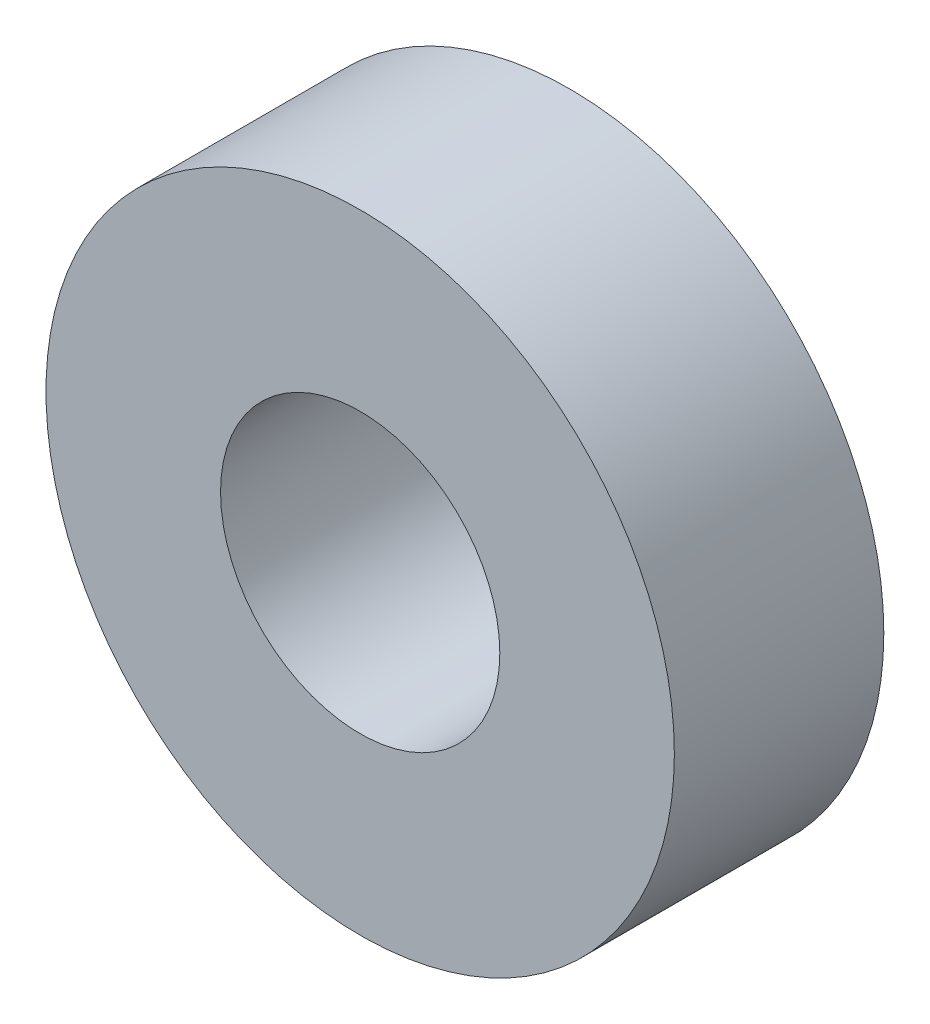
ISO-10303-21;
HEADER;
FILE_DESCRIPTION(('STEP AP214'),'2;1');
FILE_NAME('part.step','',(''),(''),'','','');
FILE_SCHEMA(('AUTOMOTIVE_DESIGN { 1 0 10303 214 1 1 1 1 }'));
ENDSEC;
DATA;
#1=APPLICATION_CONTEXT('core data for automotive mechanical design processes');
#2=APPLICATION_PROTOCOL_DEFINITION('international standard','automotive_design',2000,#1);
#3=PRODUCT_CONTEXT('',#1,'mechanical');
#4=PRODUCT('Part','Part','',(#3));
#5=PRODUCT_RELATED_PRODUCT_CATEGORY('part','',(#4));
#6=PRODUCT_DEFINITION_FORMATION('','',#4);
#7=PRODUCT_DEFINITION_CONTEXT('part definition',#1,'design');
#8=PRODUCT_DEFINITION('design','',#6,#7);
#9=PRODUCT_DEFINITION_SHAPE('','',#8);
#10=(LENGTH_UNIT() NAMED_UNIT(*) SI_UNIT(.MILLI.,.METRE.));
#11=(NAMED_UNIT(*) PLANE_ANGLE_UNIT() SI_UNIT($,.RADIAN.));
#12=(NAMED_UNIT(*) SI_UNIT($,.STERADIAN.) SOLID_ANGLE_UNIT());
#13=UNCERTAINTY_MEASURE_WITH_UNIT(LENGTH_MEASURE(1.E-05),#10,'distance_accuracy_value','');
#14=(GEOMETRIC_REPRESENTATION_CONTEXT(3) GLOBAL_UNCERTAINTY_ASSIGNED_CONTEXT((#13)) GLOBAL_UNIT_ASSIGNED_CONTEXT((#10,
#11,#12)) REPRESENTATION_CONTEXT('',''));
#15=CARTESIAN_POINT('',(0.,0.,0.));
#16=DIRECTION('',(0.,0.,1.));
#17=DIRECTION('',(1.,0.,0.));
#18=AXIS2_PLACEMENT_3D('',#15,#16,#17);
#19=CARTESIAN_POINT('',(0.,0.,-3.));
#20=DIRECTION('',(0.,0.,1.));
#21=DIRECTION('',(1.,0.,0.));
#22=AXIS2_PLACEMENT_3D('',#19,#20,#21);
#23=CYLINDRICAL_SURFACE('',#22,9.);
#24=CARTESIAN_POINT('',(0.,0.,-3.));
#25=DIRECTION('',(0.,0.,1.));
#26=DIRECTION('',(1.,0.,0.));
#27=AXIS2_PLACEMENT_3D('',#24,#25,#26);
#28=CIRCLE('',#27,9.);
#29=CARTESIAN_POINT('',(9.,0.,-3.));
#30=VERTEX_POINT('',#29);
#31=EDGE_CURVE('E10',#30,#30,#28,.T.);
#32=ORIENTED_EDGE('',*,*,#31,.T.);
#33=EDGE_LOOP('',(#32));
#34=FACE_BOUND('',#33,.T.);
#35=CARTESIAN_POINT('',(0.,0.,3.));
#36=DIRECTION('',(0.,0.,1.));
#37=DIRECTION('',(1.,0.,0.));
#38=AXIS2_PLACEMENT_3D('',#35,#36,#37);
#39=CIRCLE('',#38,9.);
#40=CARTESIAN_POINT('',(9.,0.,3.));
#41=VERTEX_POINT('',#40);
#42=EDGE_CURVE('E44',#41,#41,#39,.T.);
#43=ORIENTED_EDGE('',*,*,#42,.F.);
#44=EDGE_LOOP('',(#43));
#45=FACE_BOUND('',#44,.T.);
#46=ADVANCED_FACE('F34',(#34,#45),#23,.T.);
#47=CARTESIAN_POINT('',(0.,0.,-3.));
#48=DIRECTION('',(0.,0.,1.));
#49=DIRECTION('',(1.,0.,0.));
#50=AXIS2_PLACEMENT_3D('',#47,#48,#49);
#51=PLANE('',#50);
#52=CARTESIAN_POINT('',(0.,0.,-3.));
#53=DIRECTION('',(0.,0.,1.));
#54=DIRECTION('',(1.,0.,0.));
#55=AXIS2_PLACEMENT_3D('',#52,#53,#54);
#56=CIRCLE('',#55,4.);
#57=CARTESIAN_POINT('',(4.,0.,-3.));
#58=VERTEX_POINT('',#57);
#59=EDGE_CURVE('E40',#58,#58,#56,.T.);
#60=ORIENTED_EDGE('',*,*,#59,.T.);
#61=EDGE_LOOP('',(#60));
#62=FACE_BOUND('',#61,.T.);
#63=ORIENTED_EDGE('',*,*,#31,.F.);
#64=EDGE_LOOP('',(#63));
#65=FACE_BOUND('',#64,.T.);
#66=ADVANCED_FACE('F63',(#62,#65),#51,.F.);
#67=CARTESIAN_POINT('',(0.,0.,-3.));
#68=DIRECTION('',(0.,0.,1.));
#69=DIRECTION('',(1.,0.,0.));
#70=AXIS2_PLACEMENT_3D('',#67,#68,#69);
#71=CYLINDRICAL_SURFACE('',#70,4.);
#72=ORIENTED_EDGE('',*,*,#59,.F.);
#73=EDGE_LOOP('',(#72));
#74=FACE_BOUND('',#73,.T.);
#75=CARTESIAN_POINT('',(0.,0.,3.));
#76=DIRECTION('',(0.,0.,1.));
#77=DIRECTION('',(1.,0.,0.));
#78=AXIS2_PLACEMENT_3D('',#75,#76,#77);
#79=CIRCLE('',#78,4.);
#80=CARTESIAN_POINT('',(4.,0.,3.));
#81=VERTEX_POINT('',#80);
#82=EDGE_CURVE('E48',#81,#81,#79,.T.);
#83=ORIENTED_EDGE('',*,*,#82,.T.);
#84=EDGE_LOOP('',(#83));
#85=FACE_BOUND('',#84,.T.);
#86=ADVANCED_FACE('F54',(#74,#85),#71,.F.);
#87=CARTESIAN_POINT('',(0.,0.,3.));
#88=DIRECTION('',(0.,0.,1.));
#89=DIRECTION('',(1.,0.,0.));
#90=AXIS2_PLACEMENT_3D('',#87,#88,#89);
#91=PLANE('',#90);
#92=ORIENTED_EDGE('',*,*,#42,.T.);
#93=EDGE_LOOP('',(#92));
#94=FACE_BOUND('',#93,.T.);
#95=ORIENTED_EDGE('',*,*,#82,.F.);
#96=EDGE_LOOP('',(#95));
#97=FACE_BOUND('',#96,.T.);
#98=ADVANCED_FACE('F56',(#94,#97),#91,.T.);
#99=CLOSED_SHELL('',(#46,#66,#86,#98));
#100=MANIFOLD_SOLID_BREP('B2',#99);
#101=ADVANCED_BREP_SHAPE_REPRESENTATION('',(#18,#100),#14);
#102=SHAPE_DEFINITION_REPRESENTATION(#9,#101);
ENDSEC;
END-ISO-10303-21;
